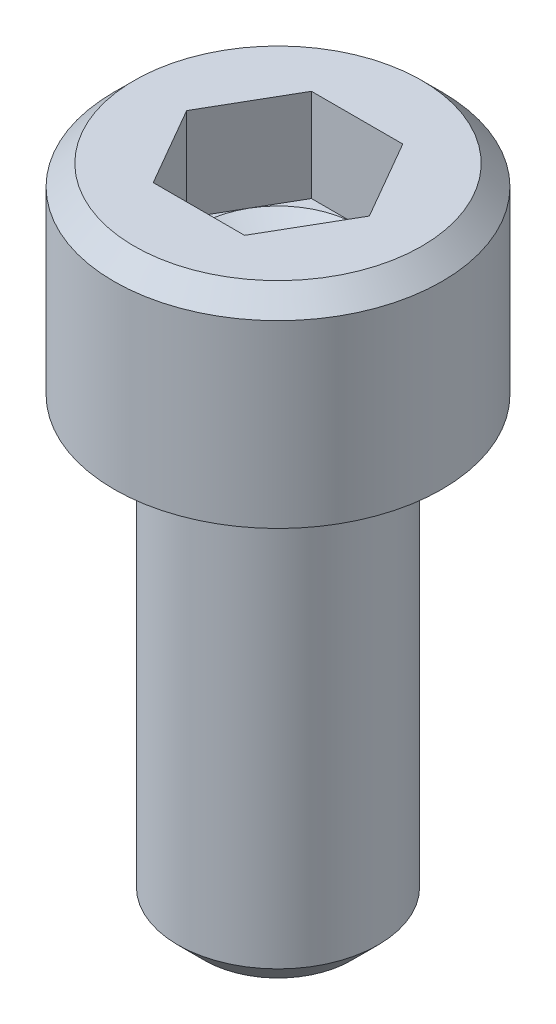
ISO-10303-21;
HEADER;
FILE_DESCRIPTION(('STEP AP214'),'2;1');
FILE_NAME('part.step','',(''),(''),'','','');
FILE_SCHEMA(('AUTOMOTIVE_DESIGN { 1 0 10303 214 1 1 1 1 }'));
ENDSEC;
DATA;
#1=APPLICATION_CONTEXT('core data for automotive mechanical design processes');
#2=APPLICATION_PROTOCOL_DEFINITION('international standard','automotive_design',2000,#1);
#3=PRODUCT_CONTEXT('',#1,'mechanical');
#4=PRODUCT('Part','Part','',(#3));
#5=PRODUCT_RELATED_PRODUCT_CATEGORY('part','',(#4));
#6=PRODUCT_DEFINITION_FORMATION('','',#4);
#7=PRODUCT_DEFINITION_CONTEXT('part definition',#1,'design');
#8=PRODUCT_DEFINITION('design','',#6,#7);
#9=PRODUCT_DEFINITION_SHAPE('','',#8);
#10=(LENGTH_UNIT() NAMED_UNIT(*) SI_UNIT(.MILLI.,.METRE.));
#11=(NAMED_UNIT(*) PLANE_ANGLE_UNIT() SI_UNIT($,.RADIAN.));
#12=(NAMED_UNIT(*) SI_UNIT($,.STERADIAN.) SOLID_ANGLE_UNIT());
#13=UNCERTAINTY_MEASURE_WITH_UNIT(LENGTH_MEASURE(1.E-05),#10,'distance_accuracy_value','');
#14=(GEOMETRIC_REPRESENTATION_CONTEXT(3) GLOBAL_UNCERTAINTY_ASSIGNED_CONTEXT((#13)) GLOBAL_UNIT_ASSIGNED_CONTEXT((#10,
#11,#12)) REPRESENTATION_CONTEXT('',''));
#15=CARTESIAN_POINT('',(0.,0.,0.));
#16=DIRECTION('',(0.,0.,1.));
#17=DIRECTION('',(1.,0.,0.));
#18=AXIS2_PLACEMENT_3D('',#15,#16,#17);
#19=CARTESIAN_POINT('',(0.,1.87959999988152,0.));
#20=DIRECTION('',(0.,1.,0.));
#21=DIRECTION('',(0.,0.,1.));
#22=AXIS2_PLACEMENT_3D('',#19,#20,#21);
#23=CONICAL_SURFACE('',#22,1.38429999981327,1.04719755105418);
#24=CARTESIAN_POINT('',(0.,1.08037402230821,-1.70530256582424E-10));
#25=VERTEX_POINT('',#24);
#26=VERTEX_LOOP('',#25);
#27=FACE_BOUND('',#26,.T.);
#28=CARTESIAN_POINT('',(0.,1.87959999997998,0.));
#29=DIRECTION('',(0.,1.,0.));
#30=DIRECTION('',(0.,0.,1.));
#31=AXIS2_PLACEMENT_3D('',#28,#29,#30);
#32=CIRCLE('',#31,1.3842999999838);
#33=CARTESIAN_POINT('',(-1.19883896645178,1.87959999998999,-0.69214999999595));
#34=VERTEX_POINT('',#33);
#35=CARTESIAN_POINT('',(0.,1.87959999998999,-1.3842999999919));
#36=VERTEX_POINT('',#35);
#37=EDGE_CURVE('E156',#34,#36,#32,.F.);
#38=ORIENTED_EDGE('',*,*,#37,.F.);
#39=CARTESIAN_POINT('',(0.,1.87959999997998,0.));
#40=DIRECTION('',(0.,1.,0.));
#41=DIRECTION('',(0.,0.,1.));
#42=AXIS2_PLACEMENT_3D('',#39,#40,#41);
#43=CIRCLE('',#42,1.3842999999838);
#44=CARTESIAN_POINT('',(-1.19883896645178,1.87959999998999,0.69214999999595));
#45=VERTEX_POINT('',#44);
#46=EDGE_CURVE('E103',#45,#34,#43,.F.);
#47=ORIENTED_EDGE('',*,*,#46,.F.);
#48=CARTESIAN_POINT('',(0.,1.87959999997998,0.));
#49=DIRECTION('',(0.,1.,0.));
#50=DIRECTION('',(0.,0.,1.));
#51=AXIS2_PLACEMENT_3D('',#48,#49,#50);
#52=CIRCLE('',#51,1.3842999999838);
#53=CARTESIAN_POINT('',(0.,1.87959999998999,1.3842999999919));
#54=VERTEX_POINT('',#53);
#55=EDGE_CURVE('E99',#54,#45,#52,.F.);
#56=ORIENTED_EDGE('',*,*,#55,.F.);
#57=CARTESIAN_POINT('',(0.,1.87959999997998,0.));
#58=DIRECTION('',(0.,1.,0.));
#59=DIRECTION('',(0.,0.,1.));
#60=AXIS2_PLACEMENT_3D('',#57,#58,#59);
#61=CIRCLE('',#60,1.3842999999838);
#62=CARTESIAN_POINT('',(1.19883896645178,1.87959999998999,0.69214999999595));
#63=VERTEX_POINT('',#62);
#64=EDGE_CURVE('E97',#63,#54,#61,.F.);
#65=ORIENTED_EDGE('',*,*,#64,.F.);
#66=CARTESIAN_POINT('',(0.,1.87959999997998,0.));
#67=DIRECTION('',(0.,1.,0.));
#68=DIRECTION('',(0.,0.,1.));
#69=AXIS2_PLACEMENT_3D('',#66,#67,#68);
#70=CIRCLE('',#69,1.3842999999838);
#71=CARTESIAN_POINT('',(1.19883896645178,1.87959999998999,-0.69214999999595));
#72=VERTEX_POINT('',#71);
#73=EDGE_CURVE('E27',#72,#63,#70,.F.);
#74=ORIENTED_EDGE('',*,*,#73,.F.);
#75=CARTESIAN_POINT('',(0.,1.87959999997998,0.));
#76=DIRECTION('',(0.,1.,0.));
#77=DIRECTION('',(0.,0.,1.));
#78=AXIS2_PLACEMENT_3D('',#75,#76,#77);
#79=CIRCLE('',#78,1.3842999999838);
#80=EDGE_CURVE('E114',#36,#72,#79,.F.);
#81=ORIENTED_EDGE('',*,*,#80,.F.);
#82=EDGE_LOOP('',(#38,#47,#56,#65,#74,#81));
#83=FACE_BOUND('',#82,.T.);
#84=ADVANCED_FACE('F24',(#27,#83),#23,.F.);
#85=CARTESIAN_POINT('',(0.,1.8796,0.));
#86=DIRECTION('',(0.,1.,0.));
#87=DIRECTION('',(0.,0.,1.));
#88=AXIS2_PLACEMENT_3D('',#85,#86,#87);
#89=PLANE('',#88);
#90=DIRECTION('',(0.5,0.,-0.866025403784438));
#91=VECTOR('',#90,1.);
#92=CARTESIAN_POINT('',(0.799225977639199,1.8796,1.3843));
#93=LINE('',#92,#91);
#94=CARTESIAN_POINT('',(1.5984519552784,1.8796,0.));
#95=VERTEX_POINT('',#94);
#96=EDGE_CURVE('E109',#63,#95,#93,.T.);
#97=ORIENTED_EDGE('',*,*,#96,.T.);
#98=DIRECTION('',(-0.499999999999999,0.,-0.866025403784439));
#99=VECTOR('',#98,1.);
#100=CARTESIAN_POINT('',(1.5984519552784,1.8796,0.));
#101=LINE('',#100,#99);
#102=EDGE_CURVE('E112',#95,#72,#101,.T.);
#103=ORIENTED_EDGE('',*,*,#102,.T.);
#104=ORIENTED_EDGE('',*,*,#73,.T.);
#105=EDGE_LOOP('',(#97,#103,#104));
#106=FACE_BOUND('',#105,.T.);
#107=ADVANCED_FACE('F107',(#106),#89,.T.);
#108=CARTESIAN_POINT('',(0.,1.8796,0.));
#109=DIRECTION('',(0.,1.,0.));
#110=DIRECTION('',(0.,0.,1.));
#111=AXIS2_PLACEMENT_3D('',#108,#109,#110);
#112=PLANE('',#111);
#113=DIRECTION('',(-0.499999999999999,0.,-0.866025403784439));
#114=VECTOR('',#113,1.);
#115=CARTESIAN_POINT('',(1.5984519552784,1.8796,0.));
#116=LINE('',#115,#114);
#117=CARTESIAN_POINT('',(0.799225977639203,1.8796,-1.3843));
#118=VERTEX_POINT('',#117);
#119=EDGE_CURVE('E123',#72,#118,#116,.T.);
#120=ORIENTED_EDGE('',*,*,#119,.T.);
#121=DIRECTION('',(-1.,0.,0.));
#122=VECTOR('',#121,1.);
#123=CARTESIAN_POINT('',(0.799225977639203,1.8796,-1.3843));
#124=LINE('',#123,#122);
#125=EDGE_CURVE('E163',#118,#36,#124,.T.);
#126=ORIENTED_EDGE('',*,*,#125,.T.);
#127=ORIENTED_EDGE('',*,*,#80,.T.);
#128=EDGE_LOOP('',(#120,#126,#127));
#129=FACE_BOUND('',#128,.T.);
#130=ADVANCED_FACE('F160',(#129),#112,.T.);
#131=CARTESIAN_POINT('',(0.,1.8796,0.));
#132=DIRECTION('',(0.,1.,0.));
#133=DIRECTION('',(0.,0.,1.));
#134=AXIS2_PLACEMENT_3D('',#131,#132,#133);
#135=PLANE('',#134);
#136=DIRECTION('',(-1.,0.,0.));
#137=VECTOR('',#136,1.);
#138=CARTESIAN_POINT('',(0.799225977639203,1.8796,-1.3843));
#139=LINE('',#138,#137);
#140=CARTESIAN_POINT('',(-0.799225977639196,1.8796,-1.3843));
#141=VERTEX_POINT('',#140);
#142=EDGE_CURVE('E168',#36,#141,#139,.T.);
#143=ORIENTED_EDGE('',*,*,#142,.T.);
#144=DIRECTION('',(-0.5,0.,0.866025403784438));
#145=VECTOR('',#144,1.);
#146=CARTESIAN_POINT('',(-0.799225977639196,1.8796,-1.3843));
#147=LINE('',#146,#145);
#148=EDGE_CURVE('E171',#141,#34,#147,.T.);
#149=ORIENTED_EDGE('',*,*,#148,.T.);
#150=ORIENTED_EDGE('',*,*,#37,.T.);
#151=EDGE_LOOP('',(#143,#149,#150));
#152=FACE_BOUND('',#151,.T.);
#153=ADVANCED_FACE('F167',(#152),#135,.T.);
#154=CARTESIAN_POINT('',(0.,1.8796,0.));
#155=DIRECTION('',(0.,1.,0.));
#156=DIRECTION('',(0.,0.,1.));
#157=AXIS2_PLACEMENT_3D('',#154,#155,#156);
#158=PLANE('',#157);
#159=DIRECTION('',(-0.5,0.,0.866025403784438));
#160=VECTOR('',#159,1.);
#161=CARTESIAN_POINT('',(-0.799225977639196,1.8796,-1.3843));
#162=LINE('',#161,#160);
#163=CARTESIAN_POINT('',(-1.5984519552784,1.8796,0.));
#164=VERTEX_POINT('',#163);
#165=EDGE_CURVE('E179',#34,#164,#162,.T.);
#166=ORIENTED_EDGE('',*,*,#165,.T.);
#167=DIRECTION('',(0.5,0.,0.866025403784439));
#168=VECTOR('',#167,1.);
#169=CARTESIAN_POINT('',(-1.5984519552784,1.8796,0.));
#170=LINE('',#169,#168);
#171=EDGE_CURVE('E238',#164,#45,#170,.T.);
#172=ORIENTED_EDGE('',*,*,#171,.T.);
#173=ORIENTED_EDGE('',*,*,#46,.T.);
#174=EDGE_LOOP('',(#166,#172,#173));
#175=FACE_BOUND('',#174,.T.);
#176=ADVANCED_FACE('F343',(#175),#158,.T.);
#177=CARTESIAN_POINT('',(0.,1.8796,0.));
#178=DIRECTION('',(0.,1.,0.));
#179=DIRECTION('',(0.,0.,1.));
#180=AXIS2_PLACEMENT_3D('',#177,#178,#179);
#181=PLANE('',#180);
#182=DIRECTION('',(1.,0.,0.));
#183=VECTOR('',#182,1.);
#184=CARTESIAN_POINT('',(-0.799225977639199,1.8796,1.3843));
#185=LINE('',#184,#183);
#186=CARTESIAN_POINT('',(0.799225977639199,1.8796,1.3843));
#187=VERTEX_POINT('',#186);
#188=EDGE_CURVE('E119',#54,#187,#185,.T.);
#189=ORIENTED_EDGE('',*,*,#188,.T.);
#190=DIRECTION('',(0.5,0.,-0.866025403784438));
#191=VECTOR('',#190,1.);
#192=CARTESIAN_POINT('',(0.799225977639199,1.8796,1.3843));
#193=LINE('',#192,#191);
#194=EDGE_CURVE('E116',#187,#63,#193,.T.);
#195=ORIENTED_EDGE('',*,*,#194,.T.);
#196=ORIENTED_EDGE('',*,*,#64,.T.);
#197=EDGE_LOOP('',(#189,#195,#196));
#198=FACE_BOUND('',#197,.T.);
#199=ADVANCED_FACE('F117',(#198),#181,.T.);
#200=CARTESIAN_POINT('',(0.,1.8796,0.));
#201=DIRECTION('',(0.,1.,0.));
#202=DIRECTION('',(0.,0.,1.));
#203=AXIS2_PLACEMENT_3D('',#200,#201,#202);
#204=PLANE('',#203);
#205=DIRECTION('',(0.5,0.,0.866025403784439));
#206=VECTOR('',#205,1.);
#207=CARTESIAN_POINT('',(-1.5984519552784,1.8796,0.));
#208=LINE('',#207,#206);
#209=CARTESIAN_POINT('',(-0.799225977639199,1.8796,1.3843));
#210=VERTEX_POINT('',#209);
#211=EDGE_CURVE('E175',#45,#210,#208,.T.);
#212=ORIENTED_EDGE('',*,*,#211,.T.);
#213=DIRECTION('',(1.,0.,0.));
#214=VECTOR('',#213,1.);
#215=CARTESIAN_POINT('',(-0.799225977639199,1.8796,1.3843));
#216=LINE('',#215,#214);
#217=EDGE_CURVE('E139',#210,#54,#216,.T.);
#218=ORIENTED_EDGE('',*,*,#217,.T.);
#219=ORIENTED_EDGE('',*,*,#55,.T.);
#220=EDGE_LOOP('',(#212,#218,#219));
#221=FACE_BOUND('',#220,.T.);
#222=ADVANCED_FACE('F337',(#221),#204,.T.);
#223=CARTESIAN_POINT('',(0.799225977639199,3.5052,1.3843));
#224=DIRECTION('',(0.866025403784438,0.,0.5));
#225=DIRECTION('',(0.5,0.,-0.866025403784438));
#226=AXIS2_PLACEMENT_3D('',#223,#224,#225);
#227=PLANE('',#226);
#228=DIRECTION('',(0.,1.,0.));
#229=VECTOR('',#228,1.);
#230=CARTESIAN_POINT('',(0.799225977639199,3.5052,1.3843));
#231=LINE('',#230,#229);
#232=CARTESIAN_POINT('',(0.799225977639199,3.5052,1.3843));
#233=VERTEX_POINT('',#232);
#234=EDGE_CURVE('E246',#187,#233,#231,.T.);
#235=ORIENTED_EDGE('',*,*,#234,.T.);
#236=DIRECTION('',(0.500000000000001,0.,-0.866025403784438));
#237=VECTOR('',#236,1.);
#238=CARTESIAN_POINT('',(0.799225977639199,3.5052,1.3843));
#239=LINE('',#238,#237);
#240=CARTESIAN_POINT('',(1.5984519552784,3.5052,0.));
#241=VERTEX_POINT('',#240);
#242=EDGE_CURVE('E136',#233,#241,#239,.T.);
#243=ORIENTED_EDGE('',*,*,#242,.T.);
#244=DIRECTION('',(0.,1.,0.));
#245=VECTOR('',#244,1.);
#246=CARTESIAN_POINT('',(1.5984519552784,3.5052,0.));
#247=LINE('',#246,#245);
#248=EDGE_CURVE('E127',#241,#95,#247,.F.);
#249=ORIENTED_EDGE('',*,*,#248,.T.);
#250=ORIENTED_EDGE('',*,*,#96,.F.);
#251=ORIENTED_EDGE('',*,*,#194,.F.);
#252=EDGE_LOOP('',(#235,#243,#249,#250,#251));
#253=FACE_BOUND('',#252,.T.);
#254=ADVANCED_FACE('F125',(#253),#227,.F.);
#255=CARTESIAN_POINT('',(1.5984519552784,3.5052,0.));
#256=DIRECTION('',(0.866025403784439,0.,-0.499999999999999));
#257=DIRECTION('',(-0.499999999999999,0.,-0.866025403784439));
#258=AXIS2_PLACEMENT_3D('',#255,#256,#257);
#259=PLANE('',#258);
#260=ORIENTED_EDGE('',*,*,#248,.F.);
#261=DIRECTION('',(-0.5,0.,-0.866025403784439));
#262=VECTOR('',#261,1.);
#263=CARTESIAN_POINT('',(1.5984519552784,3.5052,0.));
#264=LINE('',#263,#262);
#265=CARTESIAN_POINT('',(0.799225977639203,3.5052,-1.3843));
#266=VERTEX_POINT('',#265);
#267=EDGE_CURVE('E138',#241,#266,#264,.T.);
#268=ORIENTED_EDGE('',*,*,#267,.T.);
#269=DIRECTION('',(0.,1.,0.));
#270=VECTOR('',#269,1.);
#271=CARTESIAN_POINT('',(0.799225977639203,3.5052,-1.3843));
#272=LINE('',#271,#270);
#273=EDGE_CURVE('E187',#266,#118,#272,.F.);
#274=ORIENTED_EDGE('',*,*,#273,.T.);
#275=ORIENTED_EDGE('',*,*,#119,.F.);
#276=ORIENTED_EDGE('',*,*,#102,.F.);
#277=EDGE_LOOP('',(#260,#268,#274,#275,#276));
#278=FACE_BOUND('',#277,.T.);
#279=ADVANCED_FACE('F226',(#278),#259,.F.);
#280=CARTESIAN_POINT('',(0.799225977639203,3.5052,-1.3843));
#281=DIRECTION('',(0.,0.,-1.));
#282=DIRECTION('',(-1.,0.,0.));
#283=AXIS2_PLACEMENT_3D('',#280,#281,#282);
#284=PLANE('',#283);
#285=ORIENTED_EDGE('',*,*,#273,.F.);
#286=DIRECTION('',(1.,0.,0.));
#287=VECTOR('',#286,1.);
#288=CARTESIAN_POINT('',(0.,3.5052,-1.3843));
#289=LINE('',#288,#287);
#290=CARTESIAN_POINT('',(-0.799225977639196,3.5052,-1.3843));
#291=VERTEX_POINT('',#290);
#292=EDGE_CURVE('E197',#266,#291,#289,.F.);
#293=ORIENTED_EDGE('',*,*,#292,.T.);
#294=DIRECTION('',(0.,1.,0.));
#295=VECTOR('',#294,1.);
#296=CARTESIAN_POINT('',(-0.799225977639196,3.5052,-1.3843));
#297=LINE('',#296,#295);
#298=EDGE_CURVE('E176',#291,#141,#297,.F.);
#299=ORIENTED_EDGE('',*,*,#298,.T.);
#300=ORIENTED_EDGE('',*,*,#142,.F.);
#301=ORIENTED_EDGE('',*,*,#125,.F.);
#302=EDGE_LOOP('',(#285,#293,#299,#300,#301));
#303=FACE_BOUND('',#302,.T.);
#304=ADVANCED_FACE('F231',(#303),#284,.F.);
#305=CARTESIAN_POINT('',(-0.799225977639196,3.5052,-1.3843));
#306=DIRECTION('',(-0.866025403784438,0.,-0.5));
#307=DIRECTION('',(-0.5,0.,0.866025403784438));
#308=AXIS2_PLACEMENT_3D('',#305,#306,#307);
#309=PLANE('',#308);
#310=ORIENTED_EDGE('',*,*,#298,.F.);
#311=DIRECTION('',(-0.500000000000003,0.,0.866025403784437));
#312=VECTOR('',#311,1.);
#313=CARTESIAN_POINT('',(-0.799225977639196,3.5052,-1.3843));
#314=LINE('',#313,#312);
#315=CARTESIAN_POINT('',(-1.5984519552784,3.5052,0.));
#316=VERTEX_POINT('',#315);
#317=EDGE_CURVE('E195',#291,#316,#314,.T.);
#318=ORIENTED_EDGE('',*,*,#317,.T.);
#319=DIRECTION('',(0.,1.,0.));
#320=VECTOR('',#319,1.);
#321=CARTESIAN_POINT('',(-1.5984519552784,3.5052,0.));
#322=LINE('',#321,#320);
#323=EDGE_CURVE('E181',#316,#164,#322,.F.);
#324=ORIENTED_EDGE('',*,*,#323,.T.);
#325=ORIENTED_EDGE('',*,*,#165,.F.);
#326=ORIENTED_EDGE('',*,*,#148,.F.);
#327=EDGE_LOOP('',(#310,#318,#324,#325,#326));
#328=FACE_BOUND('',#327,.T.);
#329=ADVANCED_FACE('F180',(#328),#309,.F.);
#330=CARTESIAN_POINT('',(-1.5984519552784,3.5052,0.));
#331=DIRECTION('',(-0.866025403784439,0.,0.5));
#332=DIRECTION('',(0.5,0.,0.866025403784439));
#333=AXIS2_PLACEMENT_3D('',#330,#331,#332);
#334=PLANE('',#333);
#335=ORIENTED_EDGE('',*,*,#323,.F.);
#336=DIRECTION('',(0.500000000000001,0.,0.866025403784438));
#337=VECTOR('',#336,1.);
#338=CARTESIAN_POINT('',(-1.5984519552784,3.5052,0.));
#339=LINE('',#338,#337);
#340=CARTESIAN_POINT('',(-0.799225977639196,3.5052,1.3843));
#341=VERTEX_POINT('',#340);
#342=EDGE_CURVE('E42',#316,#341,#339,.T.);
#343=ORIENTED_EDGE('',*,*,#342,.T.);
#344=DIRECTION('',(0.,1.,0.));
#345=VECTOR('',#344,1.);
#346=CARTESIAN_POINT('',(-0.799225977639196,3.5052,1.3843));
#347=LINE('',#346,#345);
#348=EDGE_CURVE('E248',#341,#210,#347,.F.);
#349=ORIENTED_EDGE('',*,*,#348,.T.);
#350=ORIENTED_EDGE('',*,*,#211,.F.);
#351=ORIENTED_EDGE('',*,*,#171,.F.);
#352=EDGE_LOOP('',(#335,#343,#349,#350,#351));
#353=FACE_BOUND('',#352,.T.);
#354=ADVANCED_FACE('F236',(#353),#334,.F.);
#355=CARTESIAN_POINT('',(-0.799225977639196,3.5052,1.3843));
#356=DIRECTION('',(0.,0.,1.));
#357=DIRECTION('',(1.,0.,0.));
#358=AXIS2_PLACEMENT_3D('',#355,#356,#357);
#359=PLANE('',#358);
#360=ORIENTED_EDGE('',*,*,#348,.F.);
#361=DIRECTION('',(1.,0.,0.));
#362=VECTOR('',#361,1.);
#363=CARTESIAN_POINT('',(0.,3.5052,1.3843));
#364=LINE('',#363,#362);
#365=EDGE_CURVE('E152',#341,#233,#364,.T.);
#366=ORIENTED_EDGE('',*,*,#365,.T.);
#367=ORIENTED_EDGE('',*,*,#234,.F.);
#368=ORIENTED_EDGE('',*,*,#188,.F.);
#369=ORIENTED_EDGE('',*,*,#217,.F.);
#370=EDGE_LOOP('',(#360,#366,#367,#368,#369));
#371=FACE_BOUND('',#370,.T.);
#372=ADVANCED_FACE('F323',(#371),#359,.F.);
#373=CARTESIAN_POINT('',(0.,3.5052,0.));
#374=DIRECTION('',(0.,-1.,0.));
#375=DIRECTION('',(0.,0.,-1.));
#376=AXIS2_PLACEMENT_3D('',#373,#374,#375);
#377=PLANE('',#376);
#378=ORIENTED_EDGE('',*,*,#342,.F.);
#379=ORIENTED_EDGE('',*,*,#317,.F.);
#380=ORIENTED_EDGE('',*,*,#292,.F.);
#381=ORIENTED_EDGE('',*,*,#267,.F.);
#382=ORIENTED_EDGE('',*,*,#242,.F.);
#383=ORIENTED_EDGE('',*,*,#365,.F.);
#384=EDGE_LOOP('',(#378,#379,#380,#381,#382,#383));
#385=FACE_BOUND('',#384,.T.);
#386=CARTESIAN_POINT('',(0.,3.50519999989274,0.));
#387=DIRECTION('',(0.,-1.,0.));
#388=DIRECTION('',(1.,0.,0.));
#389=AXIS2_PLACEMENT_3D('',#386,#387,#388);
#390=CIRCLE('',#389,2.51460000004045);
#391=CARTESIAN_POINT('',(2.51460000004045,3.50519999989274,0.));
#392=VERTEX_POINT('',#391);
#393=EDGE_CURVE('E150',#392,#392,#390,.T.);
#394=ORIENTED_EDGE('',*,*,#393,.F.);
#395=EDGE_LOOP('',(#394));
#396=FACE_BOUND('',#395,.T.);
#397=ADVANCED_FACE('F233',(#385,#396),#377,.F.);
#398=CARTESIAN_POINT('',(0.,3.149599999972,0.));
#399=DIRECTION('',(0.,-1.,0.));
#400=DIRECTION('',(1.,0.,0.));
#401=AXIS2_PLACEMENT_3D('',#398,#399,#400);
#402=CONICAL_SURFACE('',#401,2.87020000001803,0.785398163477374);
#403=CARTESIAN_POINT('',(0.,3.1496,0.));
#404=DIRECTION('',(0.,-1.,0.));
#405=DIRECTION('',(0.,0.,-1.));
#406=AXIS2_PLACEMENT_3D('',#403,#404,#405);
#407=CIRCLE('',#406,2.8702);
#408=CARTESIAN_POINT('',(0.,3.1496,-2.8702));
#409=VERTEX_POINT('',#408);
#410=EDGE_CURVE('E149',#409,#409,#407,.T.);
#411=ORIENTED_EDGE('',*,*,#410,.F.);
#412=EDGE_LOOP('',(#411));
#413=FACE_BOUND('',#412,.T.);
#414=ORIENTED_EDGE('',*,*,#393,.T.);
#415=EDGE_LOOP('',(#414));
#416=FACE_BOUND('',#415,.T.);
#417=ADVANCED_FACE('F316',(#413,#416),#402,.T.);
#418=CARTESIAN_POINT('',(0.,4.077335,0.));
#419=DIRECTION('',(0.,-1.,0.));
#420=DIRECTION('',(0.,0.,-1.));
#421=AXIS2_PLACEMENT_3D('',#418,#419,#420);
#422=CYLINDRICAL_SURFACE('',#421,2.8702);
#423=CARTESIAN_POINT('',(0.,0.,0.));
#424=DIRECTION('',(0.,-1.,0.));
#425=DIRECTION('',(0.,0.,-1.));
#426=AXIS2_PLACEMENT_3D('',#423,#424,#425);
#427=CIRCLE('',#426,2.8702);
#428=CARTESIAN_POINT('',(0.,0.,-2.8702));
#429=VERTEX_POINT('',#428);
#430=EDGE_CURVE('E146',#429,#429,#427,.T.);
#431=ORIENTED_EDGE('',*,*,#430,.F.);
#432=EDGE_LOOP('',(#431));
#433=FACE_BOUND('',#432,.T.);
#434=ORIENTED_EDGE('',*,*,#410,.T.);
#435=EDGE_LOOP('',(#434));
#436=FACE_BOUND('',#435,.T.);
#437=ADVANCED_FACE('F313',(#433,#436),#422,.T.);
#438=CARTESIAN_POINT('',(0.,0.,0.));
#439=DIRECTION('',(0.,-1.,0.));
#440=DIRECTION('',(0.,0.,-1.));
#441=AXIS2_PLACEMENT_3D('',#438,#439,#440);
#442=PLANE('',#441);
#443=CARTESIAN_POINT('',(0.,0.,0.));
#444=DIRECTION('',(0.,-1.,0.));
#445=DIRECTION('',(-1.,0.,-1.5435934800795E-13));
#446=AXIS2_PLACEMENT_3D('',#443,#444,#445);
#447=CIRCLE('',#446,2.0066);
#448=CARTESIAN_POINT('',(-2.0066,0.,-3.09737467712751E-13));
#449=VERTEX_POINT('',#448);
#450=EDGE_CURVE('E145',#449,#449,#447,.F.);
#451=ORIENTED_EDGE('',*,*,#450,.T.);
#452=EDGE_LOOP('',(#451));
#453=FACE_BOUND('',#452,.T.);
#454=ORIENTED_EDGE('',*,*,#430,.T.);
#455=EDGE_LOOP('',(#454));
#456=FACE_BOUND('',#455,.T.);
#457=ADVANCED_FACE('F304',(#453,#456),#442,.T.);
#458=CARTESIAN_POINT('',(0.,-7.9375,0.));
#459=DIRECTION('',(0.,-1.,0.));
#460=DIRECTION('',(0.,0.,-1.));
#461=AXIS2_PLACEMENT_3D('',#458,#459,#460);
#462=PLANE('',#461);
#463=CARTESIAN_POINT('',(0.,-7.93749999996862,0.));
#464=DIRECTION('',(0.,1.,0.));
#465=DIRECTION('',(0.,0.,1.));
#466=AXIS2_PLACEMENT_3D('',#463,#464,#465);
#467=CIRCLE('',#466,1.28016000002162);
#468=CARTESIAN_POINT('',(0.,-7.93749999996862,1.28016000002162));
#469=VERTEX_POINT('',#468);
#470=EDGE_CURVE('E142',#469,#469,#467,.T.);
#471=ORIENTED_EDGE('',*,*,#470,.F.);
#472=EDGE_LOOP('',(#471));
#473=FACE_BOUND('',#472,.T.);
#474=ADVANCED_FACE('F291',(#473),#462,.T.);
#475=CARTESIAN_POINT('',(0.,-0.253999999999997,0.));
#476=DIRECTION('',(0.,-1.,0.));
#477=DIRECTION('',(0.,0.,-1.));
#478=AXIS2_PLACEMENT_3D('',#475,#476,#477);
#479=TOROIDAL_SURFACE('',#478,2.0066,0.254);
#480=CARTESIAN_POINT('',(0.,-0.253999999999997,0.));
#481=DIRECTION('',(0.,-1.,0.));
#482=DIRECTION('',(0.,0.,-1.));
#483=AXIS2_PLACEMENT_3D('',#480,#481,#482);
#484=CIRCLE('',#483,1.7526);
#485=CARTESIAN_POINT('',(0.,-0.253999999999997,-1.7526));
#486=VERTEX_POINT('',#485);
#487=EDGE_CURVE('E33',#486,#486,#484,.T.);
#488=ORIENTED_EDGE('',*,*,#487,.F.);
#489=EDGE_LOOP('',(#488));
#490=FACE_BOUND('',#489,.T.);
#491=ORIENTED_EDGE('',*,*,#450,.F.);
#492=EDGE_LOOP('',(#491));
#493=FACE_BOUND('',#492,.T.);
#494=ADVANCED_FACE('F279',(#490,#493),#479,.F.);
#495=CARTESIAN_POINT('',(0.,-7.46506000012914,0.));
#496=DIRECTION('',(0.,1.,0.));
#497=DIRECTION('',(0.,0.,1.));
#498=AXIS2_PLACEMENT_3D('',#495,#496,#497);
#499=CONICAL_SURFACE('',#498,1.75259999980426,0.785398163337289);
#500=ORIENTED_EDGE('',*,*,#470,.T.);
#501=EDGE_LOOP('',(#500));
#502=FACE_BOUND('',#501,.T.);
#503=CARTESIAN_POINT('',(0.,-7.46506,0.));
#504=DIRECTION('',(0.,-1.,0.));
#505=DIRECTION('',(0.,0.,-1.));
#506=AXIS2_PLACEMENT_3D('',#503,#504,#505);
#507=CIRCLE('',#506,1.7526);
#508=CARTESIAN_POINT('',(0.,-7.46506,-1.7526));
#509=VERTEX_POINT('',#508);
#510=EDGE_CURVE('E13',#509,#509,#507,.F.);
#511=ORIENTED_EDGE('',*,*,#510,.F.);
#512=EDGE_LOOP('',(#511));
#513=FACE_BOUND('',#512,.T.);
#514=ADVANCED_FACE('F290',(#502,#513),#499,.T.);
#515=CARTESIAN_POINT('',(0.,4.077335,0.));
#516=DIRECTION('',(0.,-1.,0.));
#517=DIRECTION('',(0.,0.,-1.));
#518=AXIS2_PLACEMENT_3D('',#515,#516,#517);
#519=CYLINDRICAL_SURFACE('',#518,1.7526);
#520=ORIENTED_EDGE('',*,*,#510,.T.);
#521=EDGE_LOOP('',(#520));
#522=FACE_BOUND('',#521,.T.);
#523=ORIENTED_EDGE('',*,*,#487,.T.);
#524=EDGE_LOOP('',(#523));
#525=FACE_BOUND('',#524,.T.);
#526=ADVANCED_FACE('F355',(#522,#525),#519,.T.);
#527=CLOSED_SHELL('',(#84,#107,#130,#153,#176,#199,#222,#254,#279,#304,#329,#354,#372,#397,#417,
#437,#457,#474,#494,#514,#526));
#528=MANIFOLD_SOLID_BREP('B1',#527);
#529=ADVANCED_BREP_SHAPE_REPRESENTATION('',(#18,#528),#14);
#530=SHAPE_DEFINITION_REPRESENTATION(#9,#529);
ENDSEC;
END-ISO-10303-21;
